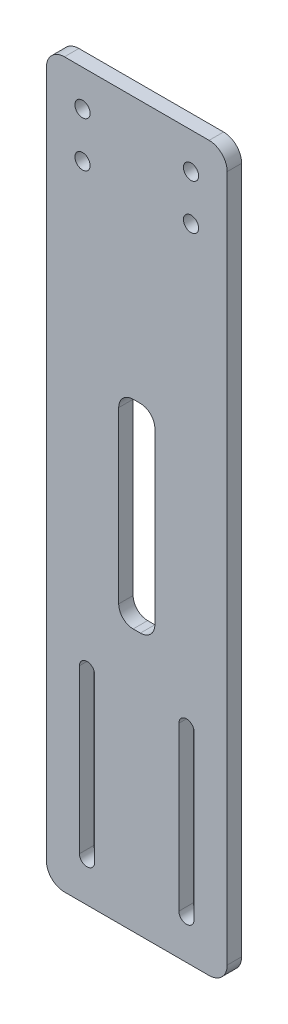
ISO-10303-21;
HEADER;
FILE_DESCRIPTION(('STEP AP214'),'2;1');
FILE_NAME('part.step','',(''),(''),'','','');
FILE_SCHEMA(('AUTOMOTIVE_DESIGN { 1 0 10303 214 1 1 1 1 }'));
ENDSEC;
DATA;
#1=APPLICATION_CONTEXT('core data for automotive mechanical design processes');
#2=APPLICATION_PROTOCOL_DEFINITION('international standard','automotive_design',2000,#1);
#3=PRODUCT_CONTEXT('',#1,'mechanical');
#4=PRODUCT('Part','Part','',(#3));
#5=PRODUCT_RELATED_PRODUCT_CATEGORY('part','',(#4));
#6=PRODUCT_DEFINITION_FORMATION('','',#4);
#7=PRODUCT_DEFINITION_CONTEXT('part definition',#1,'design');
#8=PRODUCT_DEFINITION('design','',#6,#7);
#9=PRODUCT_DEFINITION_SHAPE('','',#8);
#10=(LENGTH_UNIT() NAMED_UNIT(*) SI_UNIT(.MILLI.,.METRE.));
#11=(NAMED_UNIT(*) PLANE_ANGLE_UNIT() SI_UNIT($,.RADIAN.));
#12=(NAMED_UNIT(*) SI_UNIT($,.STERADIAN.) SOLID_ANGLE_UNIT());
#13=UNCERTAINTY_MEASURE_WITH_UNIT(LENGTH_MEASURE(1.E-05),#10,'distance_accuracy_value','');
#14=(GEOMETRIC_REPRESENTATION_CONTEXT(3) GLOBAL_UNCERTAINTY_ASSIGNED_CONTEXT((#13)) GLOBAL_UNIT_ASSIGNED_CONTEXT((#10,
#11,#12)) REPRESENTATION_CONTEXT('',''));
#15=CARTESIAN_POINT('',(0.,0.,0.));
#16=DIRECTION('',(0.,0.,1.));
#17=DIRECTION('',(1.,0.,0.));
#18=AXIS2_PLACEMENT_3D('',#15,#16,#17);
#19=CARTESIAN_POINT('',(40.,-190.,-8.));
#20=DIRECTION('',(0.,0.,1.));
#21=DIRECTION('',(1.,0.,0.));
#22=AXIS2_PLACEMENT_3D('',#19,#20,#21);
#23=CYLINDRICAL_SURFACE('',#22,10.);
#24=CARTESIAN_POINT('',(40.,-190.,0.));
#25=DIRECTION('',(0.,0.,1.));
#26=DIRECTION('',(1.,0.,0.));
#27=AXIS2_PLACEMENT_3D('',#24,#25,#26);
#28=CIRCLE('',#27,10.);
#29=CARTESIAN_POINT('',(40.,-200.,0.));
#30=VERTEX_POINT('',#29);
#31=CARTESIAN_POINT('',(50.,-190.,0.));
#32=VERTEX_POINT('',#31);
#33=EDGE_CURVE('E353',#30,#32,#28,.T.);
#34=ORIENTED_EDGE('',*,*,#33,.F.);
#35=DIRECTION('',(0.,0.,1.));
#36=VECTOR('',#35,1.);
#37=CARTESIAN_POINT('',(40.,-200.,-8.));
#38=LINE('',#37,#36);
#39=CARTESIAN_POINT('',(40.,-200.,-8.));
#40=VERTEX_POINT('',#39);
#41=EDGE_CURVE('E11',#40,#30,#38,.T.);
#42=ORIENTED_EDGE('',*,*,#41,.F.);
#43=CARTESIAN_POINT('',(40.,-190.,-8.));
#44=DIRECTION('',(0.,0.,1.));
#45=DIRECTION('',(1.,0.,0.));
#46=AXIS2_PLACEMENT_3D('',#43,#44,#45);
#47=CIRCLE('',#46,10.);
#48=CARTESIAN_POINT('',(50.,-190.,-8.));
#49=VERTEX_POINT('',#48);
#50=EDGE_CURVE('E360',#40,#49,#47,.T.);
#51=ORIENTED_EDGE('',*,*,#50,.T.);
#52=DIRECTION('',(0.,0.,1.));
#53=VECTOR('',#52,1.);
#54=CARTESIAN_POINT('',(50.,-190.,-8.));
#55=LINE('',#54,#53);
#56=EDGE_CURVE('E45',#49,#32,#55,.T.);
#57=ORIENTED_EDGE('',*,*,#56,.T.);
#58=EDGE_LOOP('',(#34,#42,#51,#57));
#59=FACE_BOUND('',#58,.T.);
#60=ADVANCED_FACE('F42',(#59),#23,.T.);
#61=CARTESIAN_POINT('',(-39.9999999999999,-200.,-8.));
#62=DIRECTION('',(0.,-1.,0.));
#63=DIRECTION('',(0.,0.,-1.));
#64=AXIS2_PLACEMENT_3D('',#61,#62,#63);
#65=PLANE('',#64);
#66=DIRECTION('',(1.,0.,0.));
#67=VECTOR('',#66,1.);
#68=CARTESIAN_POINT('',(-39.9999999999999,-200.,0.));
#69=LINE('',#68,#67);
#70=CARTESIAN_POINT('',(-39.9999999999999,-200.,0.));
#71=VERTEX_POINT('',#70);
#72=EDGE_CURVE('E364',#71,#30,#69,.T.);
#73=ORIENTED_EDGE('',*,*,#72,.F.);
#74=DIRECTION('',(0.,0.,1.));
#75=VECTOR('',#74,1.);
#76=CARTESIAN_POINT('',(-39.9999999999999,-200.,-8.));
#77=LINE('',#76,#75);
#78=CARTESIAN_POINT('',(-39.9999999999999,-200.,-8.));
#79=VERTEX_POINT('',#78);
#80=EDGE_CURVE('E50',#79,#71,#77,.T.);
#81=ORIENTED_EDGE('',*,*,#80,.F.);
#82=DIRECTION('',(1.,0.,0.));
#83=VECTOR('',#82,1.);
#84=CARTESIAN_POINT('',(-39.9999999999999,-200.,-8.));
#85=LINE('',#84,#83);
#86=EDGE_CURVE('E382',#79,#40,#85,.T.);
#87=ORIENTED_EDGE('',*,*,#86,.T.);
#88=ORIENTED_EDGE('',*,*,#41,.T.);
#89=EDGE_LOOP('',(#73,#81,#87,#88));
#90=FACE_BOUND('',#89,.T.);
#91=ADVANCED_FACE('F429',(#90),#65,.T.);
#92=CARTESIAN_POINT('',(-40.,-190.,-8.));
#93=DIRECTION('',(0.,0.,1.));
#94=DIRECTION('',(1.,0.,0.));
#95=AXIS2_PLACEMENT_3D('',#92,#93,#94);
#96=CYLINDRICAL_SURFACE('',#95,10.);
#97=CARTESIAN_POINT('',(-40.,-190.,0.));
#98=DIRECTION('',(0.,0.,1.));
#99=DIRECTION('',(-1.,0.,0.));
#100=AXIS2_PLACEMENT_3D('',#97,#98,#99);
#101=CIRCLE('',#100,10.);
#102=CARTESIAN_POINT('',(-50.,-190.,0.));
#103=VERTEX_POINT('',#102);
#104=EDGE_CURVE('E402',#103,#71,#101,.T.);
#105=ORIENTED_EDGE('',*,*,#104,.F.);
#106=DIRECTION('',(0.,0.,1.));
#107=VECTOR('',#106,1.);
#108=CARTESIAN_POINT('',(-50.,-190.,-8.));
#109=LINE('',#108,#107);
#110=CARTESIAN_POINT('',(-50.,-190.,-8.));
#111=VERTEX_POINT('',#110);
#112=EDGE_CURVE('E408',#111,#103,#109,.T.);
#113=ORIENTED_EDGE('',*,*,#112,.F.);
#114=CARTESIAN_POINT('',(-40.,-190.,-8.));
#115=DIRECTION('',(0.,0.,1.));
#116=DIRECTION('',(-1.,0.,0.));
#117=AXIS2_PLACEMENT_3D('',#114,#115,#116);
#118=CIRCLE('',#117,10.);
#119=EDGE_CURVE('E379',#111,#79,#118,.T.);
#120=ORIENTED_EDGE('',*,*,#119,.T.);
#121=ORIENTED_EDGE('',*,*,#80,.T.);
#122=EDGE_LOOP('',(#105,#113,#120,#121));
#123=FACE_BOUND('',#122,.T.);
#124=ADVANCED_FACE('F449',(#123),#96,.T.);
#125=CARTESIAN_POINT('',(-50.,190.,-8.));
#126=DIRECTION('',(-1.,0.,0.));
#127=DIRECTION('',(0.,-1.,0.));
#128=AXIS2_PLACEMENT_3D('',#125,#126,#127);
#129=PLANE('',#128);
#130=DIRECTION('',(0.,-1.,0.));
#131=VECTOR('',#130,1.);
#132=CARTESIAN_POINT('',(-50.,190.,0.));
#133=LINE('',#132,#131);
#134=CARTESIAN_POINT('',(-50.,190.,0.));
#135=VERTEX_POINT('',#134);
#136=EDGE_CURVE('E399',#135,#103,#133,.T.);
#137=ORIENTED_EDGE('',*,*,#136,.F.);
#138=DIRECTION('',(0.,0.,1.));
#139=VECTOR('',#138,1.);
#140=CARTESIAN_POINT('',(-50.,190.,-8.));
#141=LINE('',#140,#139);
#142=CARTESIAN_POINT('',(-50.,190.,-8.));
#143=VERTEX_POINT('',#142);
#144=EDGE_CURVE('E410',#143,#135,#141,.T.);
#145=ORIENTED_EDGE('',*,*,#144,.F.);
#146=DIRECTION('',(0.,-1.,0.));
#147=VECTOR('',#146,1.);
#148=CARTESIAN_POINT('',(-50.,190.,-8.));
#149=LINE('',#148,#147);
#150=EDGE_CURVE('E376',#143,#111,#149,.T.);
#151=ORIENTED_EDGE('',*,*,#150,.T.);
#152=ORIENTED_EDGE('',*,*,#112,.T.);
#153=EDGE_LOOP('',(#137,#145,#151,#152));
#154=FACE_BOUND('',#153,.T.);
#155=ADVANCED_FACE('F447',(#154),#129,.T.);
#156=CARTESIAN_POINT('',(-40.,190.,-8.));
#157=DIRECTION('',(0.,0.,1.));
#158=DIRECTION('',(1.,0.,0.));
#159=AXIS2_PLACEMENT_3D('',#156,#157,#158);
#160=CYLINDRICAL_SURFACE('',#159,10.);
#161=CARTESIAN_POINT('',(-40.,190.,0.));
#162=DIRECTION('',(0.,0.,1.));
#163=DIRECTION('',(1.,0.,0.));
#164=AXIS2_PLACEMENT_3D('',#161,#162,#163);
#165=CIRCLE('',#164,10.);
#166=CARTESIAN_POINT('',(-39.9999999999999,200.,0.));
#167=VERTEX_POINT('',#166);
#168=EDGE_CURVE('E396',#167,#135,#165,.T.);
#169=ORIENTED_EDGE('',*,*,#168,.F.);
#170=DIRECTION('',(0.,0.,1.));
#171=VECTOR('',#170,1.);
#172=CARTESIAN_POINT('',(-39.9999999999999,200.,-8.));
#173=LINE('',#172,#171);
#174=CARTESIAN_POINT('',(-39.9999999999999,200.,-8.));
#175=VERTEX_POINT('',#174);
#176=EDGE_CURVE('E412',#175,#167,#173,.T.);
#177=ORIENTED_EDGE('',*,*,#176,.F.);
#178=CARTESIAN_POINT('',(-40.,190.,-8.));
#179=DIRECTION('',(0.,0.,1.));
#180=DIRECTION('',(1.,0.,0.));
#181=AXIS2_PLACEMENT_3D('',#178,#179,#180);
#182=CIRCLE('',#181,10.);
#183=EDGE_CURVE('E373',#175,#143,#182,.T.);
#184=ORIENTED_EDGE('',*,*,#183,.T.);
#185=ORIENTED_EDGE('',*,*,#144,.T.);
#186=EDGE_LOOP('',(#169,#177,#184,#185));
#187=FACE_BOUND('',#186,.T.);
#188=ADVANCED_FACE('F443',(#187),#160,.T.);
#189=CARTESIAN_POINT('',(-39.9999999999999,200.,-8.));
#190=DIRECTION('',(0.,1.,0.));
#191=DIRECTION('',(0.,0.,1.));
#192=AXIS2_PLACEMENT_3D('',#189,#190,#191);
#193=PLANE('',#192);
#194=DIRECTION('',(-1.,0.,0.));
#195=VECTOR('',#194,1.);
#196=CARTESIAN_POINT('',(-39.9999999999999,200.,0.));
#197=LINE('',#196,#195);
#198=CARTESIAN_POINT('',(39.9999999999999,200.,0.));
#199=VERTEX_POINT('',#198);
#200=EDGE_CURVE('E393',#199,#167,#197,.T.);
#201=ORIENTED_EDGE('',*,*,#200,.F.);
#202=DIRECTION('',(0.,0.,1.));
#203=VECTOR('',#202,1.);
#204=CARTESIAN_POINT('',(39.9999999999999,200.,-8.));
#205=LINE('',#204,#203);
#206=CARTESIAN_POINT('',(39.9999999999999,200.,-8.));
#207=VERTEX_POINT('',#206);
#208=EDGE_CURVE('E414',#207,#199,#205,.T.);
#209=ORIENTED_EDGE('',*,*,#208,.F.);
#210=DIRECTION('',(-1.,0.,0.));
#211=VECTOR('',#210,1.);
#212=CARTESIAN_POINT('',(-39.9999999999999,200.,-8.));
#213=LINE('',#212,#211);
#214=EDGE_CURVE('E370',#207,#175,#213,.T.);
#215=ORIENTED_EDGE('',*,*,#214,.T.);
#216=ORIENTED_EDGE('',*,*,#176,.T.);
#217=EDGE_LOOP('',(#201,#209,#215,#216));
#218=FACE_BOUND('',#217,.T.);
#219=ADVANCED_FACE('F441',(#218),#193,.T.);
#220=CARTESIAN_POINT('',(40.,190.,-8.));
#221=DIRECTION('',(0.,0.,1.));
#222=DIRECTION('',(1.,0.,0.));
#223=AXIS2_PLACEMENT_3D('',#220,#221,#222);
#224=CYLINDRICAL_SURFACE('',#223,10.);
#225=CARTESIAN_POINT('',(40.,190.,0.));
#226=DIRECTION('',(0.,0.,1.));
#227=DIRECTION('',(1.,0.,0.));
#228=AXIS2_PLACEMENT_3D('',#225,#226,#227);
#229=CIRCLE('',#228,10.);
#230=CARTESIAN_POINT('',(50.,190.,0.));
#231=VERTEX_POINT('',#230);
#232=EDGE_CURVE('E390',#231,#199,#229,.T.);
#233=ORIENTED_EDGE('',*,*,#232,.F.);
#234=DIRECTION('',(0.,0.,1.));
#235=VECTOR('',#234,1.);
#236=CARTESIAN_POINT('',(50.,190.,-8.));
#237=LINE('',#236,#235);
#238=CARTESIAN_POINT('',(50.,190.,-8.));
#239=VERTEX_POINT('',#238);
#240=EDGE_CURVE('E415',#239,#231,#237,.T.);
#241=ORIENTED_EDGE('',*,*,#240,.F.);
#242=CARTESIAN_POINT('',(40.,190.,-8.));
#243=DIRECTION('',(0.,0.,1.));
#244=DIRECTION('',(1.,0.,0.));
#245=AXIS2_PLACEMENT_3D('',#242,#243,#244);
#246=CIRCLE('',#245,10.);
#247=EDGE_CURVE('E367',#239,#207,#246,.T.);
#248=ORIENTED_EDGE('',*,*,#247,.T.);
#249=ORIENTED_EDGE('',*,*,#208,.T.);
#250=EDGE_LOOP('',(#233,#241,#248,#249));
#251=FACE_BOUND('',#250,.T.);
#252=ADVANCED_FACE('F437',(#251),#224,.T.);
#253=CARTESIAN_POINT('',(50.,190.,-8.));
#254=DIRECTION('',(1.,0.,0.));
#255=DIRECTION('',(0.,1.,0.));
#256=AXIS2_PLACEMENT_3D('',#253,#254,#255);
#257=PLANE('',#256);
#258=DIRECTION('',(0.,1.,0.));
#259=VECTOR('',#258,1.);
#260=CARTESIAN_POINT('',(50.,190.,0.));
#261=LINE('',#260,#259);
#262=EDGE_CURVE('E387',#32,#231,#261,.T.);
#263=ORIENTED_EDGE('',*,*,#262,.F.);
#264=ORIENTED_EDGE('',*,*,#56,.F.);
#265=DIRECTION('',(0.,1.,0.));
#266=VECTOR('',#265,1.);
#267=CARTESIAN_POINT('',(50.,190.,-8.));
#268=LINE('',#267,#266);
#269=EDGE_CURVE('E363',#49,#239,#268,.T.);
#270=ORIENTED_EDGE('',*,*,#269,.T.);
#271=ORIENTED_EDGE('',*,*,#240,.T.);
#272=EDGE_LOOP('',(#263,#264,#270,#271));
#273=FACE_BOUND('',#272,.T.);
#274=ADVANCED_FACE('F423',(#273),#257,.T.);
#275=CARTESIAN_POINT('',(40.,-190.,-8.));
#276=DIRECTION('',(0.,0.,1.));
#277=DIRECTION('',(1.,0.,0.));
#278=AXIS2_PLACEMENT_3D('',#275,#276,#277);
#279=PLANE('',#278);
#280=DIRECTION('',(0.,-1.,0.));
#281=VECTOR('',#280,1.);
#282=CARTESIAN_POINT('',(-9.99999999999998,-47.,-8.));
#283=LINE('',#282,#281);
#284=CARTESIAN_POINT('',(-9.99999999999998,47.,-8.));
#285=VERTEX_POINT('',#284);
#286=CARTESIAN_POINT('',(-9.99999999999998,-47.,-8.));
#287=VERTEX_POINT('',#286);
#288=EDGE_CURVE('E211',#285,#287,#283,.T.);
#289=ORIENTED_EDGE('',*,*,#288,.T.);
#290=CARTESIAN_POINT('',(-1.99999999999998,-47.,-8.));
#291=DIRECTION('',(0.,0.,1.));
#292=DIRECTION('',(-1.,0.,0.));
#293=AXIS2_PLACEMENT_3D('',#290,#291,#292);
#294=CIRCLE('',#293,8.);
#295=CARTESIAN_POINT('',(-1.99999999999998,-55.,-8.));
#296=VERTEX_POINT('',#295);
#297=EDGE_CURVE('E205',#287,#296,#294,.T.);
#298=ORIENTED_EDGE('',*,*,#297,.T.);
#299=DIRECTION('',(1.,0.,0.));
#300=VECTOR('',#299,1.);
#301=CARTESIAN_POINT('',(-1.99999999999998,-55.,-8.));
#302=LINE('',#301,#300);
#303=CARTESIAN_POINT('',(2.00000000000002,-55.,-8.));
#304=VERTEX_POINT('',#303);
#305=EDGE_CURVE('E214',#296,#304,#302,.T.);
#306=ORIENTED_EDGE('',*,*,#305,.T.);
#307=CARTESIAN_POINT('',(2.00000000000002,-47.,-8.));
#308=DIRECTION('',(0.,0.,1.));
#309=DIRECTION('',(1.,0.,0.));
#310=AXIS2_PLACEMENT_3D('',#307,#308,#309);
#311=CIRCLE('',#310,8.);
#312=CARTESIAN_POINT('',(10.,-47.,-8.));
#313=VERTEX_POINT('',#312);
#314=EDGE_CURVE('E58',#304,#313,#311,.T.);
#315=ORIENTED_EDGE('',*,*,#314,.T.);
#316=DIRECTION('',(0.,1.,0.));
#317=VECTOR('',#316,1.);
#318=CARTESIAN_POINT('',(10.,-47.,-8.));
#319=LINE('',#318,#317);
#320=CARTESIAN_POINT('',(10.,47.,-8.));
#321=VERTEX_POINT('',#320);
#322=EDGE_CURVE('E229',#313,#321,#319,.T.);
#323=ORIENTED_EDGE('',*,*,#322,.T.);
#324=CARTESIAN_POINT('',(2.00000000000002,47.,-8.));
#325=DIRECTION('',(0.,0.,1.));
#326=DIRECTION('',(-1.,0.,0.));
#327=AXIS2_PLACEMENT_3D('',#324,#325,#326);
#328=CIRCLE('',#327,8.);
#329=CARTESIAN_POINT('',(2.00000000000002,55.,-8.));
#330=VERTEX_POINT('',#329);
#331=EDGE_CURVE('E232',#321,#330,#328,.T.);
#332=ORIENTED_EDGE('',*,*,#331,.T.);
#333=DIRECTION('',(-1.,0.,0.));
#334=VECTOR('',#333,1.);
#335=CARTESIAN_POINT('',(-1.99999999999998,55.,-8.));
#336=LINE('',#335,#334);
#337=CARTESIAN_POINT('',(-1.99999999999998,55.,-8.));
#338=VERTEX_POINT('',#337);
#339=EDGE_CURVE('E235',#330,#338,#336,.T.);
#340=ORIENTED_EDGE('',*,*,#339,.T.);
#341=CARTESIAN_POINT('',(-1.99999999999998,47.,-8.));
#342=DIRECTION('',(0.,0.,1.));
#343=DIRECTION('',(1.,0.,0.));
#344=AXIS2_PLACEMENT_3D('',#341,#342,#343);
#345=CIRCLE('',#344,8.);
#346=EDGE_CURVE('E238',#338,#285,#345,.T.);
#347=ORIENTED_EDGE('',*,*,#346,.T.);
#348=EDGE_LOOP('',(#289,#298,#306,#315,#323,#332,#340,#347));
#349=FACE_BOUND('',#348,.T.);
#350=CARTESIAN_POINT('',(30.,155.,-8.));
#351=DIRECTION('',(0.,0.,1.));
#352=DIRECTION('',(1.,0.,0.));
#353=AXIS2_PLACEMENT_3D('',#350,#351,#352);
#354=CIRCLE('',#353,4.2);
#355=CARTESIAN_POINT('',(34.2,155.,-8.));
#356=VERTEX_POINT('',#355);
#357=EDGE_CURVE('E272',#356,#356,#354,.T.);
#358=ORIENTED_EDGE('',*,*,#357,.T.);
#359=EDGE_LOOP('',(#358));
#360=FACE_BOUND('',#359,.T.);
#361=CARTESIAN_POINT('',(-30.,155.,-8.));
#362=DIRECTION('',(0.,0.,1.));
#363=DIRECTION('',(1.,0.,0.));
#364=AXIS2_PLACEMENT_3D('',#361,#362,#363);
#365=CIRCLE('',#364,4.2);
#366=CARTESIAN_POINT('',(-25.8,155.,-8.));
#367=VERTEX_POINT('',#366);
#368=EDGE_CURVE('E278',#367,#367,#365,.T.);
#369=ORIENTED_EDGE('',*,*,#368,.T.);
#370=EDGE_LOOP('',(#369));
#371=FACE_BOUND('',#370,.T.);
#372=CARTESIAN_POINT('',(30.,180.,-8.));
#373=DIRECTION('',(0.,0.,1.));
#374=DIRECTION('',(1.,0.,0.));
#375=AXIS2_PLACEMENT_3D('',#372,#373,#374);
#376=CIRCLE('',#375,4.2);
#377=CARTESIAN_POINT('',(34.2,180.,-8.));
#378=VERTEX_POINT('',#377);
#379=EDGE_CURVE('E284',#378,#378,#376,.T.);
#380=ORIENTED_EDGE('',*,*,#379,.T.);
#381=EDGE_LOOP('',(#380));
#382=FACE_BOUND('',#381,.T.);
#383=CARTESIAN_POINT('',(-30.,180.,-8.));
#384=DIRECTION('',(0.,0.,1.));
#385=DIRECTION('',(1.,0.,0.));
#386=AXIS2_PLACEMENT_3D('',#383,#384,#385);
#387=CIRCLE('',#386,4.2);
#388=CARTESIAN_POINT('',(-25.8,180.,-8.));
#389=VERTEX_POINT('',#388);
#390=EDGE_CURVE('E290',#389,#389,#387,.T.);
#391=ORIENTED_EDGE('',*,*,#390,.T.);
#392=EDGE_LOOP('',(#391));
#393=FACE_BOUND('',#392,.T.);
#394=DIRECTION('',(0.,1.,0.));
#395=VECTOR('',#394,1.);
#396=CARTESIAN_POINT('',(31.7,-87.5,-8.));
#397=LINE('',#396,#395);
#398=CARTESIAN_POINT('',(31.7,-177.5,-8.));
#399=VERTEX_POINT('',#398);
#400=CARTESIAN_POINT('',(31.7,-87.5,-8.));
#401=VERTEX_POINT('',#400);
#402=EDGE_CURVE('E306',#399,#401,#397,.T.);
#403=ORIENTED_EDGE('',*,*,#402,.T.);
#404=CARTESIAN_POINT('',(27.5,-87.5,-8.));
#405=DIRECTION('',(0.,0.,1.));
#406=DIRECTION('',(1.,0.,0.));
#407=AXIS2_PLACEMENT_3D('',#404,#405,#406);
#408=CIRCLE('',#407,4.19999999999999);
#409=CARTESIAN_POINT('',(23.3,-87.5,-8.));
#410=VERTEX_POINT('',#409);
#411=EDGE_CURVE('E296',#401,#410,#408,.T.);
#412=ORIENTED_EDGE('',*,*,#411,.T.);
#413=DIRECTION('',(0.,-1.,0.));
#414=VECTOR('',#413,1.);
#415=CARTESIAN_POINT('',(23.3,-87.5,-8.));
#416=LINE('',#415,#414);
#417=CARTESIAN_POINT('',(23.3,-177.5,-8.));
#418=VERTEX_POINT('',#417);
#419=EDGE_CURVE('E299',#410,#418,#416,.T.);
#420=ORIENTED_EDGE('',*,*,#419,.T.);
#421=CARTESIAN_POINT('',(27.5,-177.5,-8.));
#422=DIRECTION('',(0.,0.,1.));
#423=DIRECTION('',(1.,0.,0.));
#424=AXIS2_PLACEMENT_3D('',#421,#422,#423);
#425=CIRCLE('',#424,4.2);
#426=EDGE_CURVE('E303',#418,#399,#425,.T.);
#427=ORIENTED_EDGE('',*,*,#426,.T.);
#428=EDGE_LOOP('',(#403,#412,#420,#427));
#429=FACE_BOUND('',#428,.T.);
#430=DIRECTION('',(0.,-1.,0.));
#431=VECTOR('',#430,1.);
#432=CARTESIAN_POINT('',(-31.7,-87.5,-8.));
#433=LINE('',#432,#431);
#434=CARTESIAN_POINT('',(-31.7,-87.5,-8.));
#435=VERTEX_POINT('',#434);
#436=CARTESIAN_POINT('',(-31.7,-177.5,-8.));
#437=VERTEX_POINT('',#436);
#438=EDGE_CURVE('E338',#435,#437,#433,.T.);
#439=ORIENTED_EDGE('',*,*,#438,.T.);
#440=CARTESIAN_POINT('',(-27.5,-177.5,-8.));
#441=DIRECTION('',(0.,0.,1.));
#442=DIRECTION('',(1.,0.,0.));
#443=AXIS2_PLACEMENT_3D('',#440,#441,#442);
#444=CIRCLE('',#443,4.2);
#445=CARTESIAN_POINT('',(-23.3,-177.5,-8.));
#446=VERTEX_POINT('',#445);
#447=EDGE_CURVE('E328',#437,#446,#444,.T.);
#448=ORIENTED_EDGE('',*,*,#447,.T.);
#449=DIRECTION('',(0.,1.,0.));
#450=VECTOR('',#449,1.);
#451=CARTESIAN_POINT('',(-23.3,-177.5,-8.));
#452=LINE('',#451,#450);
#453=CARTESIAN_POINT('',(-23.3,-87.5000000000001,-8.));
#454=VERTEX_POINT('',#453);
#455=EDGE_CURVE('E331',#446,#454,#452,.T.);
#456=ORIENTED_EDGE('',*,*,#455,.T.);
#457=CARTESIAN_POINT('',(-27.5,-87.5,-8.));
#458=DIRECTION('',(0.,0.,1.));
#459=DIRECTION('',(1.,0.,0.));
#460=AXIS2_PLACEMENT_3D('',#457,#458,#459);
#461=CIRCLE('',#460,4.19999999999999);
#462=EDGE_CURVE('E335',#454,#435,#461,.T.);
#463=ORIENTED_EDGE('',*,*,#462,.T.);
#464=EDGE_LOOP('',(#439,#448,#456,#463));
#465=FACE_BOUND('',#464,.T.);
#466=ORIENTED_EDGE('',*,*,#50,.F.);
#467=ORIENTED_EDGE('',*,*,#86,.F.);
#468=ORIENTED_EDGE('',*,*,#119,.F.);
#469=ORIENTED_EDGE('',*,*,#150,.F.);
#470=ORIENTED_EDGE('',*,*,#183,.F.);
#471=ORIENTED_EDGE('',*,*,#214,.F.);
#472=ORIENTED_EDGE('',*,*,#247,.F.);
#473=ORIENTED_EDGE('',*,*,#269,.F.);
#474=EDGE_LOOP('',(#466,#467,#468,#469,#470,#471,#472,#473));
#475=FACE_BOUND('',#474,.T.);
#476=ADVANCED_FACE('F218',(#349,#360,#371,#382,#393,#429,#465,#475),#279,.F.);
#477=CARTESIAN_POINT('',(40.,-190.,0.));
#478=DIRECTION('',(0.,0.,1.));
#479=DIRECTION('',(1.,0.,0.));
#480=AXIS2_PLACEMENT_3D('',#477,#478,#479);
#481=PLANE('',#480);
#482=CARTESIAN_POINT('',(-1.99999999999998,-47.,0.));
#483=DIRECTION('',(0.,0.,1.));
#484=DIRECTION('',(-1.,0.,0.));
#485=AXIS2_PLACEMENT_3D('',#482,#483,#484);
#486=CIRCLE('',#485,8.);
#487=CARTESIAN_POINT('',(-9.99999999999998,-47.,0.));
#488=VERTEX_POINT('',#487);
#489=CARTESIAN_POINT('',(-1.99999999999998,-55.,0.));
#490=VERTEX_POINT('',#489);
#491=EDGE_CURVE('E66',#488,#490,#486,.T.);
#492=ORIENTED_EDGE('',*,*,#491,.F.);
#493=DIRECTION('',(0.,-1.,0.));
#494=VECTOR('',#493,1.);
#495=CARTESIAN_POINT('',(-9.99999999999998,-47.,0.));
#496=LINE('',#495,#494);
#497=CARTESIAN_POINT('',(-9.99999999999998,47.,0.));
#498=VERTEX_POINT('',#497);
#499=EDGE_CURVE('E222',#498,#488,#496,.T.);
#500=ORIENTED_EDGE('',*,*,#499,.F.);
#501=CARTESIAN_POINT('',(-1.99999999999998,47.,0.));
#502=DIRECTION('',(0.,0.,1.));
#503=DIRECTION('',(1.,0.,0.));
#504=AXIS2_PLACEMENT_3D('',#501,#502,#503);
#505=CIRCLE('',#504,8.);
#506=CARTESIAN_POINT('',(-1.99999999999998,55.,0.));
#507=VERTEX_POINT('',#506);
#508=EDGE_CURVE('E225',#507,#498,#505,.T.);
#509=ORIENTED_EDGE('',*,*,#508,.F.);
#510=DIRECTION('',(-1.,0.,0.));
#511=VECTOR('',#510,1.);
#512=CARTESIAN_POINT('',(-1.99999999999998,55.,0.));
#513=LINE('',#512,#511);
#514=CARTESIAN_POINT('',(2.00000000000002,55.,0.));
#515=VERTEX_POINT('',#514);
#516=EDGE_CURVE('E253',#515,#507,#513,.T.);
#517=ORIENTED_EDGE('',*,*,#516,.F.);
#518=CARTESIAN_POINT('',(2.00000000000002,47.,0.));
#519=DIRECTION('',(0.,0.,1.));
#520=DIRECTION('',(-1.,0.,0.));
#521=AXIS2_PLACEMENT_3D('',#518,#519,#520);
#522=CIRCLE('',#521,8.);
#523=CARTESIAN_POINT('',(10.,47.,0.));
#524=VERTEX_POINT('',#523);
#525=EDGE_CURVE('E250',#524,#515,#522,.T.);
#526=ORIENTED_EDGE('',*,*,#525,.F.);
#527=DIRECTION('',(0.,1.,0.));
#528=VECTOR('',#527,1.);
#529=CARTESIAN_POINT('',(10.,-47.,0.));
#530=LINE('',#529,#528);
#531=CARTESIAN_POINT('',(10.,-47.,0.));
#532=VERTEX_POINT('',#531);
#533=EDGE_CURVE('E247',#532,#524,#530,.T.);
#534=ORIENTED_EDGE('',*,*,#533,.F.);
#535=CARTESIAN_POINT('',(2.00000000000002,-47.,0.));
#536=DIRECTION('',(0.,0.,1.));
#537=DIRECTION('',(1.,0.,0.));
#538=AXIS2_PLACEMENT_3D('',#535,#536,#537);
#539=CIRCLE('',#538,8.);
#540=CARTESIAN_POINT('',(2.00000000000002,-55.,0.));
#541=VERTEX_POINT('',#540);
#542=EDGE_CURVE('E244',#541,#532,#539,.T.);
#543=ORIENTED_EDGE('',*,*,#542,.F.);
#544=DIRECTION('',(1.,0.,0.));
#545=VECTOR('',#544,1.);
#546=CARTESIAN_POINT('',(-1.99999999999998,-55.,0.));
#547=LINE('',#546,#545);
#548=EDGE_CURVE('E242',#490,#541,#547,.T.);
#549=ORIENTED_EDGE('',*,*,#548,.F.);
#550=EDGE_LOOP('',(#492,#500,#509,#517,#526,#534,#543,#549));
#551=FACE_BOUND('',#550,.T.);
#552=CARTESIAN_POINT('',(30.,155.,0.));
#553=DIRECTION('',(0.,0.,1.));
#554=DIRECTION('',(1.,0.,0.));
#555=AXIS2_PLACEMENT_3D('',#552,#553,#554);
#556=CIRCLE('',#555,4.2);
#557=CARTESIAN_POINT('',(34.2,155.,0.));
#558=VERTEX_POINT('',#557);
#559=EDGE_CURVE('E260',#558,#558,#556,.T.);
#560=ORIENTED_EDGE('',*,*,#559,.F.);
#561=EDGE_LOOP('',(#560));
#562=FACE_BOUND('',#561,.T.);
#563=CARTESIAN_POINT('',(-30.,155.,0.));
#564=DIRECTION('',(0.,0.,1.));
#565=DIRECTION('',(1.,0.,0.));
#566=AXIS2_PLACEMENT_3D('',#563,#564,#565);
#567=CIRCLE('',#566,4.2);
#568=CARTESIAN_POINT('',(-25.8,155.,0.));
#569=VERTEX_POINT('',#568);
#570=EDGE_CURVE('E275',#569,#569,#567,.T.);
#571=ORIENTED_EDGE('',*,*,#570,.F.);
#572=EDGE_LOOP('',(#571));
#573=FACE_BOUND('',#572,.T.);
#574=CARTESIAN_POINT('',(30.,180.,0.));
#575=DIRECTION('',(0.,0.,1.));
#576=DIRECTION('',(1.,0.,0.));
#577=AXIS2_PLACEMENT_3D('',#574,#575,#576);
#578=CIRCLE('',#577,4.2);
#579=CARTESIAN_POINT('',(34.2,180.,0.));
#580=VERTEX_POINT('',#579);
#581=EDGE_CURVE('E281',#580,#580,#578,.T.);
#582=ORIENTED_EDGE('',*,*,#581,.F.);
#583=EDGE_LOOP('',(#582));
#584=FACE_BOUND('',#583,.T.);
#585=CARTESIAN_POINT('',(-30.,180.,0.));
#586=DIRECTION('',(0.,0.,1.));
#587=DIRECTION('',(1.,0.,0.));
#588=AXIS2_PLACEMENT_3D('',#585,#586,#587);
#589=CIRCLE('',#588,4.2);
#590=CARTESIAN_POINT('',(-25.8,180.,0.));
#591=VERTEX_POINT('',#590);
#592=EDGE_CURVE('E287',#591,#591,#589,.T.);
#593=ORIENTED_EDGE('',*,*,#592,.F.);
#594=EDGE_LOOP('',(#593));
#595=FACE_BOUND('',#594,.T.);
#596=CARTESIAN_POINT('',(27.5,-87.5,0.));
#597=DIRECTION('',(0.,0.,1.));
#598=DIRECTION('',(1.,0.,0.));
#599=AXIS2_PLACEMENT_3D('',#596,#597,#598);
#600=CIRCLE('',#599,4.19999999999999);
#601=CARTESIAN_POINT('',(31.7,-87.5,0.));
#602=VERTEX_POINT('',#601);
#603=CARTESIAN_POINT('',(23.3,-87.5,0.));
#604=VERTEX_POINT('',#603);
#605=EDGE_CURVE('E293',#602,#604,#600,.T.);
#606=ORIENTED_EDGE('',*,*,#605,.F.);
#607=DIRECTION('',(0.,1.,0.));
#608=VECTOR('',#607,1.);
#609=CARTESIAN_POINT('',(31.7,-87.5,0.));
#610=LINE('',#609,#608);
#611=CARTESIAN_POINT('',(31.7,-177.5,0.));
#612=VERTEX_POINT('',#611);
#613=EDGE_CURVE('E300',#612,#602,#610,.T.);
#614=ORIENTED_EDGE('',*,*,#613,.F.);
#615=CARTESIAN_POINT('',(27.5,-177.5,0.));
#616=DIRECTION('',(0.,0.,1.));
#617=DIRECTION('',(1.,0.,0.));
#618=AXIS2_PLACEMENT_3D('',#615,#616,#617);
#619=CIRCLE('',#618,4.2);
#620=CARTESIAN_POINT('',(23.3,-177.5,0.));
#621=VERTEX_POINT('',#620);
#622=EDGE_CURVE('E314',#621,#612,#619,.T.);
#623=ORIENTED_EDGE('',*,*,#622,.F.);
#624=DIRECTION('',(0.,-1.,0.));
#625=VECTOR('',#624,1.);
#626=CARTESIAN_POINT('',(23.3,-87.5,0.));
#627=LINE('',#626,#625);
#628=EDGE_CURVE('E311',#604,#621,#627,.T.);
#629=ORIENTED_EDGE('',*,*,#628,.F.);
#630=EDGE_LOOP('',(#606,#614,#623,#629));
#631=FACE_BOUND('',#630,.T.);
#632=CARTESIAN_POINT('',(-27.5,-177.5,0.));
#633=DIRECTION('',(0.,0.,1.));
#634=DIRECTION('',(1.,0.,0.));
#635=AXIS2_PLACEMENT_3D('',#632,#633,#634);
#636=CIRCLE('',#635,4.2);
#637=CARTESIAN_POINT('',(-31.7,-177.5,0.));
#638=VERTEX_POINT('',#637);
#639=CARTESIAN_POINT('',(-23.3,-177.5,0.));
#640=VERTEX_POINT('',#639);
#641=EDGE_CURVE('E321',#638,#640,#636,.T.);
#642=ORIENTED_EDGE('',*,*,#641,.F.);
#643=DIRECTION('',(0.,-1.,0.));
#644=VECTOR('',#643,1.);
#645=CARTESIAN_POINT('',(-31.7,-87.5,0.));
#646=LINE('',#645,#644);
#647=CARTESIAN_POINT('',(-31.7,-87.5,0.));
#648=VERTEX_POINT('',#647);
#649=EDGE_CURVE('E332',#648,#638,#646,.T.);
#650=ORIENTED_EDGE('',*,*,#649,.F.);
#651=CARTESIAN_POINT('',(-27.5,-87.5,0.));
#652=DIRECTION('',(0.,0.,1.));
#653=DIRECTION('',(1.,0.,0.));
#654=AXIS2_PLACEMENT_3D('',#651,#652,#653);
#655=CIRCLE('',#654,4.19999999999999);
#656=CARTESIAN_POINT('',(-23.3,-87.5000000000001,0.));
#657=VERTEX_POINT('',#656);
#658=EDGE_CURVE('E346',#657,#648,#655,.T.);
#659=ORIENTED_EDGE('',*,*,#658,.F.);
#660=DIRECTION('',(0.,1.,0.));
#661=VECTOR('',#660,1.);
#662=CARTESIAN_POINT('',(-23.3,-177.5,0.));
#663=LINE('',#662,#661);
#664=EDGE_CURVE('E343',#640,#657,#663,.T.);
#665=ORIENTED_EDGE('',*,*,#664,.F.);
#666=EDGE_LOOP('',(#642,#650,#659,#665));
#667=FACE_BOUND('',#666,.T.);
#668=ORIENTED_EDGE('',*,*,#33,.T.);
#669=ORIENTED_EDGE('',*,*,#262,.T.);
#670=ORIENTED_EDGE('',*,*,#232,.T.);
#671=ORIENTED_EDGE('',*,*,#200,.T.);
#672=ORIENTED_EDGE('',*,*,#168,.T.);
#673=ORIENTED_EDGE('',*,*,#136,.T.);
#674=ORIENTED_EDGE('',*,*,#104,.T.);
#675=ORIENTED_EDGE('',*,*,#72,.T.);
#676=EDGE_LOOP('',(#668,#669,#670,#671,#672,#673,#674,#675));
#677=FACE_BOUND('',#676,.T.);
#678=ADVANCED_FACE('F425',(#551,#562,#573,#584,#595,#631,#667,#677),#481,.T.);
#679=CARTESIAN_POINT('',(-27.5,-177.5,-8.));
#680=DIRECTION('',(0.,0.,1.));
#681=DIRECTION('',(1.,0.,0.));
#682=AXIS2_PLACEMENT_3D('',#679,#680,#681);
#683=CYLINDRICAL_SURFACE('',#682,4.2);
#684=ORIENTED_EDGE('',*,*,#641,.T.);
#685=DIRECTION('',(0.,0.,1.));
#686=VECTOR('',#685,1.);
#687=CARTESIAN_POINT('',(-23.3,-177.5,-8.));
#688=LINE('',#687,#686);
#689=EDGE_CURVE('E341',#446,#640,#688,.T.);
#690=ORIENTED_EDGE('',*,*,#689,.F.);
#691=ORIENTED_EDGE('',*,*,#447,.F.);
#692=DIRECTION('',(0.,0.,1.));
#693=VECTOR('',#692,1.);
#694=CARTESIAN_POINT('',(-31.7,-177.5,-8.));
#695=LINE('',#694,#693);
#696=EDGE_CURVE('E351',#437,#638,#695,.T.);
#697=ORIENTED_EDGE('',*,*,#696,.T.);
#698=EDGE_LOOP('',(#684,#690,#691,#697));
#699=FACE_BOUND('',#698,.T.);
#700=ADVANCED_FACE('F533',(#699),#683,.F.);
#701=CARTESIAN_POINT('',(-31.7,-87.5,-8.));
#702=DIRECTION('',(-1.,0.,0.));
#703=DIRECTION('',(0.,-1.,0.));
#704=AXIS2_PLACEMENT_3D('',#701,#702,#703);
#705=PLANE('',#704);
#706=ORIENTED_EDGE('',*,*,#649,.T.);
#707=ORIENTED_EDGE('',*,*,#696,.F.);
#708=ORIENTED_EDGE('',*,*,#438,.F.);
#709=DIRECTION('',(0.,0.,1.));
#710=VECTOR('',#709,1.);
#711=CARTESIAN_POINT('',(-31.7,-87.5,-8.));
#712=LINE('',#711,#710);
#713=EDGE_CURVE('E354',#435,#648,#712,.T.);
#714=ORIENTED_EDGE('',*,*,#713,.T.);
#715=EDGE_LOOP('',(#706,#707,#708,#714));
#716=FACE_BOUND('',#715,.T.);
#717=ADVANCED_FACE('F544',(#716),#705,.F.);
#718=CARTESIAN_POINT('',(-27.5,-87.5,-8.));
#719=DIRECTION('',(0.,0.,1.));
#720=DIRECTION('',(1.,0.,0.));
#721=AXIS2_PLACEMENT_3D('',#718,#719,#720);
#722=CYLINDRICAL_SURFACE('',#721,4.19999999999999);
#723=ORIENTED_EDGE('',*,*,#658,.T.);
#724=ORIENTED_EDGE('',*,*,#713,.F.);
#725=ORIENTED_EDGE('',*,*,#462,.F.);
#726=DIRECTION('',(0.,0.,1.));
#727=VECTOR('',#726,1.);
#728=CARTESIAN_POINT('',(-23.3,-87.5000000000001,-8.));
#729=LINE('',#728,#727);
#730=EDGE_CURVE('E356',#454,#657,#729,.T.);
#731=ORIENTED_EDGE('',*,*,#730,.T.);
#732=EDGE_LOOP('',(#723,#724,#725,#731));
#733=FACE_BOUND('',#732,.T.);
#734=ADVANCED_FACE('F555',(#733),#722,.F.);
#735=CARTESIAN_POINT('',(-23.3,-177.5,-8.));
#736=DIRECTION('',(1.,0.,0.));
#737=DIRECTION('',(0.,1.,0.));
#738=AXIS2_PLACEMENT_3D('',#735,#736,#737);
#739=PLANE('',#738);
#740=ORIENTED_EDGE('',*,*,#664,.T.);
#741=ORIENTED_EDGE('',*,*,#730,.F.);
#742=ORIENTED_EDGE('',*,*,#455,.F.);
#743=ORIENTED_EDGE('',*,*,#689,.T.);
#744=EDGE_LOOP('',(#740,#741,#742,#743));
#745=FACE_BOUND('',#744,.T.);
#746=ADVANCED_FACE('F566',(#745),#739,.F.);
#747=CARTESIAN_POINT('',(27.5,-87.5,-8.));
#748=DIRECTION('',(0.,0.,1.));
#749=DIRECTION('',(1.,0.,0.));
#750=AXIS2_PLACEMENT_3D('',#747,#748,#749);
#751=CYLINDRICAL_SURFACE('',#750,4.19999999999999);
#752=ORIENTED_EDGE('',*,*,#605,.T.);
#753=DIRECTION('',(0.,0.,1.));
#754=VECTOR('',#753,1.);
#755=CARTESIAN_POINT('',(23.3,-87.5,-8.));
#756=LINE('',#755,#754);
#757=EDGE_CURVE('E309',#410,#604,#756,.T.);
#758=ORIENTED_EDGE('',*,*,#757,.F.);
#759=ORIENTED_EDGE('',*,*,#411,.F.);
#760=DIRECTION('',(0.,0.,1.));
#761=VECTOR('',#760,1.);
#762=CARTESIAN_POINT('',(31.7,-87.5,-8.));
#763=LINE('',#762,#761);
#764=EDGE_CURVE('E319',#401,#602,#763,.T.);
#765=ORIENTED_EDGE('',*,*,#764,.T.);
#766=EDGE_LOOP('',(#752,#758,#759,#765));
#767=FACE_BOUND('',#766,.T.);
#768=ADVANCED_FACE('F577',(#767),#751,.F.);
#769=CARTESIAN_POINT('',(31.7,-87.5,-8.));
#770=DIRECTION('',(1.,0.,0.));
#771=DIRECTION('',(0.,1.,0.));
#772=AXIS2_PLACEMENT_3D('',#769,#770,#771);
#773=PLANE('',#772);
#774=ORIENTED_EDGE('',*,*,#613,.T.);
#775=ORIENTED_EDGE('',*,*,#764,.F.);
#776=ORIENTED_EDGE('',*,*,#402,.F.);
#777=DIRECTION('',(0.,0.,1.));
#778=VECTOR('',#777,1.);
#779=CARTESIAN_POINT('',(31.7,-177.5,-8.));
#780=LINE('',#779,#778);
#781=EDGE_CURVE('E322',#399,#612,#780,.T.);
#782=ORIENTED_EDGE('',*,*,#781,.T.);
#783=EDGE_LOOP('',(#774,#775,#776,#782));
#784=FACE_BOUND('',#783,.T.);
#785=ADVANCED_FACE('F588',(#784),#773,.F.);
#786=CARTESIAN_POINT('',(27.5,-177.5,-8.));
#787=DIRECTION('',(0.,0.,1.));
#788=DIRECTION('',(1.,0.,0.));
#789=AXIS2_PLACEMENT_3D('',#786,#787,#788);
#790=CYLINDRICAL_SURFACE('',#789,4.2);
#791=ORIENTED_EDGE('',*,*,#622,.T.);
#792=ORIENTED_EDGE('',*,*,#781,.F.);
#793=ORIENTED_EDGE('',*,*,#426,.F.);
#794=DIRECTION('',(0.,0.,1.));
#795=VECTOR('',#794,1.);
#796=CARTESIAN_POINT('',(23.3,-177.5,-8.));
#797=LINE('',#796,#795);
#798=EDGE_CURVE('E324',#418,#621,#797,.T.);
#799=ORIENTED_EDGE('',*,*,#798,.T.);
#800=EDGE_LOOP('',(#791,#792,#793,#799));
#801=FACE_BOUND('',#800,.T.);
#802=ADVANCED_FACE('F599',(#801),#790,.F.);
#803=CARTESIAN_POINT('',(23.3,-87.5,-8.));
#804=DIRECTION('',(-1.,0.,0.));
#805=DIRECTION('',(0.,-1.,0.));
#806=AXIS2_PLACEMENT_3D('',#803,#804,#805);
#807=PLANE('',#806);
#808=ORIENTED_EDGE('',*,*,#628,.T.);
#809=ORIENTED_EDGE('',*,*,#798,.F.);
#810=ORIENTED_EDGE('',*,*,#419,.F.);
#811=ORIENTED_EDGE('',*,*,#757,.T.);
#812=EDGE_LOOP('',(#808,#809,#810,#811));
#813=FACE_BOUND('',#812,.T.);
#814=ADVANCED_FACE('F610',(#813),#807,.F.);
#815=CARTESIAN_POINT('',(-30.,180.,-8.));
#816=DIRECTION('',(0.,0.,1.));
#817=DIRECTION('',(1.,0.,0.));
#818=AXIS2_PLACEMENT_3D('',#815,#816,#817);
#819=CYLINDRICAL_SURFACE('',#818,4.2);
#820=ORIENTED_EDGE('',*,*,#390,.F.);
#821=EDGE_LOOP('',(#820));
#822=FACE_BOUND('',#821,.T.);
#823=ORIENTED_EDGE('',*,*,#592,.T.);
#824=EDGE_LOOP('',(#823));
#825=FACE_BOUND('',#824,.T.);
#826=ADVANCED_FACE('F621',(#822,#825),#819,.F.);
#827=CARTESIAN_POINT('',(30.,180.,-8.));
#828=DIRECTION('',(0.,0.,1.));
#829=DIRECTION('',(1.,0.,0.));
#830=AXIS2_PLACEMENT_3D('',#827,#828,#829);
#831=CYLINDRICAL_SURFACE('',#830,4.2);
#832=ORIENTED_EDGE('',*,*,#379,.F.);
#833=EDGE_LOOP('',(#832));
#834=FACE_BOUND('',#833,.T.);
#835=ORIENTED_EDGE('',*,*,#581,.T.);
#836=EDGE_LOOP('',(#835));
#837=FACE_BOUND('',#836,.T.);
#838=ADVANCED_FACE('F632',(#834,#837),#831,.F.);
#839=CARTESIAN_POINT('',(-30.,155.,-8.));
#840=DIRECTION('',(0.,0.,1.));
#841=DIRECTION('',(1.,0.,0.));
#842=AXIS2_PLACEMENT_3D('',#839,#840,#841);
#843=CYLINDRICAL_SURFACE('',#842,4.2);
#844=ORIENTED_EDGE('',*,*,#368,.F.);
#845=EDGE_LOOP('',(#844));
#846=FACE_BOUND('',#845,.T.);
#847=ORIENTED_EDGE('',*,*,#570,.T.);
#848=EDGE_LOOP('',(#847));
#849=FACE_BOUND('',#848,.T.);
#850=ADVANCED_FACE('F643',(#846,#849),#843,.F.);
#851=CARTESIAN_POINT('',(30.,155.,-8.));
#852=DIRECTION('',(0.,0.,1.));
#853=DIRECTION('',(1.,0.,0.));
#854=AXIS2_PLACEMENT_3D('',#851,#852,#853);
#855=CYLINDRICAL_SURFACE('',#854,4.2);
#856=ORIENTED_EDGE('',*,*,#357,.F.);
#857=EDGE_LOOP('',(#856));
#858=FACE_BOUND('',#857,.T.);
#859=ORIENTED_EDGE('',*,*,#559,.T.);
#860=EDGE_LOOP('',(#859));
#861=FACE_BOUND('',#860,.T.);
#862=ADVANCED_FACE('F654',(#858,#861),#855,.F.);
#863=CARTESIAN_POINT('',(-1.99999999999998,-47.,-8.));
#864=DIRECTION('',(0.,0.,1.));
#865=DIRECTION('',(1.,0.,0.));
#866=AXIS2_PLACEMENT_3D('',#863,#864,#865);
#867=CYLINDRICAL_SURFACE('',#866,8.);
#868=ORIENTED_EDGE('',*,*,#491,.T.);
#869=DIRECTION('',(0.,0.,1.));
#870=VECTOR('',#869,1.);
#871=CARTESIAN_POINT('',(-1.99999999999998,-55.,-8.));
#872=LINE('',#871,#870);
#873=EDGE_CURVE('E201',#296,#490,#872,.T.);
#874=ORIENTED_EDGE('',*,*,#873,.F.);
#875=ORIENTED_EDGE('',*,*,#297,.F.);
#876=DIRECTION('',(0.,0.,1.));
#877=VECTOR('',#876,1.);
#878=CARTESIAN_POINT('',(-9.99999999999998,-47.,-8.));
#879=LINE('',#878,#877);
#880=EDGE_CURVE('E258',#287,#488,#879,.T.);
#881=ORIENTED_EDGE('',*,*,#880,.T.);
#882=EDGE_LOOP('',(#868,#874,#875,#881));
#883=FACE_BOUND('',#882,.T.);
#884=ADVANCED_FACE('F203',(#883),#867,.F.);
#885=CARTESIAN_POINT('',(-9.99999999999998,-47.,-8.));
#886=DIRECTION('',(-1.,0.,0.));
#887=DIRECTION('',(0.,0.,1.));
#888=AXIS2_PLACEMENT_3D('',#885,#886,#887);
#889=PLANE('',#888);
#890=ORIENTED_EDGE('',*,*,#499,.T.);
#891=ORIENTED_EDGE('',*,*,#880,.F.);
#892=ORIENTED_EDGE('',*,*,#288,.F.);
#893=DIRECTION('',(0.,0.,1.));
#894=VECTOR('',#893,1.);
#895=CARTESIAN_POINT('',(-9.99999999999998,47.,-8.));
#896=LINE('',#895,#894);
#897=EDGE_CURVE('E261',#285,#498,#896,.T.);
#898=ORIENTED_EDGE('',*,*,#897,.T.);
#899=EDGE_LOOP('',(#890,#891,#892,#898));
#900=FACE_BOUND('',#899,.T.);
#901=ADVANCED_FACE('F675',(#900),#889,.F.);
#902=CARTESIAN_POINT('',(-1.99999999999998,47.,-8.));
#903=DIRECTION('',(0.,0.,1.));
#904=DIRECTION('',(1.,0.,0.));
#905=AXIS2_PLACEMENT_3D('',#902,#903,#904);
#906=CYLINDRICAL_SURFACE('',#905,8.);
#907=ORIENTED_EDGE('',*,*,#508,.T.);
#908=ORIENTED_EDGE('',*,*,#897,.F.);
#909=ORIENTED_EDGE('',*,*,#346,.F.);
#910=DIRECTION('',(0.,0.,1.));
#911=VECTOR('',#910,1.);
#912=CARTESIAN_POINT('',(-1.99999999999998,55.,-8.));
#913=LINE('',#912,#911);
#914=EDGE_CURVE('E263',#338,#507,#913,.T.);
#915=ORIENTED_EDGE('',*,*,#914,.T.);
#916=EDGE_LOOP('',(#907,#908,#909,#915));
#917=FACE_BOUND('',#916,.T.);
#918=ADVANCED_FACE('F685',(#917),#906,.F.);
#919=CARTESIAN_POINT('',(-1.99999999999998,55.,-8.));
#920=DIRECTION('',(0.,1.,0.));
#921=DIRECTION('',(0.,0.,1.));
#922=AXIS2_PLACEMENT_3D('',#919,#920,#921);
#923=PLANE('',#922);
#924=ORIENTED_EDGE('',*,*,#516,.T.);
#925=ORIENTED_EDGE('',*,*,#914,.F.);
#926=ORIENTED_EDGE('',*,*,#339,.F.);
#927=DIRECTION('',(0.,0.,1.));
#928=VECTOR('',#927,1.);
#929=CARTESIAN_POINT('',(2.00000000000002,55.,-8.));
#930=LINE('',#929,#928);
#931=EDGE_CURVE('E265',#330,#515,#930,.T.);
#932=ORIENTED_EDGE('',*,*,#931,.T.);
#933=EDGE_LOOP('',(#924,#925,#926,#932));
#934=FACE_BOUND('',#933,.T.);
#935=ADVANCED_FACE('F696',(#934),#923,.F.);
#936=CARTESIAN_POINT('',(2.00000000000002,47.,-8.));
#937=DIRECTION('',(0.,0.,1.));
#938=DIRECTION('',(1.,0.,0.));
#939=AXIS2_PLACEMENT_3D('',#936,#937,#938);
#940=CYLINDRICAL_SURFACE('',#939,8.);
#941=ORIENTED_EDGE('',*,*,#525,.T.);
#942=ORIENTED_EDGE('',*,*,#931,.F.);
#943=ORIENTED_EDGE('',*,*,#331,.F.);
#944=DIRECTION('',(0.,0.,1.));
#945=VECTOR('',#944,1.);
#946=CARTESIAN_POINT('',(10.,47.,-8.));
#947=LINE('',#946,#945);
#948=EDGE_CURVE('E267',#321,#524,#947,.T.);
#949=ORIENTED_EDGE('',*,*,#948,.T.);
#950=EDGE_LOOP('',(#941,#942,#943,#949));
#951=FACE_BOUND('',#950,.T.);
#952=ADVANCED_FACE('F707',(#951),#940,.F.);
#953=CARTESIAN_POINT('',(10.,-47.,-8.));
#954=DIRECTION('',(1.,0.,0.));
#955=DIRECTION('',(0.,0.,-1.));
#956=AXIS2_PLACEMENT_3D('',#953,#954,#955);
#957=PLANE('',#956);
#958=ORIENTED_EDGE('',*,*,#533,.T.);
#959=ORIENTED_EDGE('',*,*,#948,.F.);
#960=ORIENTED_EDGE('',*,*,#322,.F.);
#961=DIRECTION('',(0.,0.,1.));
#962=VECTOR('',#961,1.);
#963=CARTESIAN_POINT('',(10.,-47.,-8.));
#964=LINE('',#963,#962);
#965=EDGE_CURVE('E269',#313,#532,#964,.T.);
#966=ORIENTED_EDGE('',*,*,#965,.T.);
#967=EDGE_LOOP('',(#958,#959,#960,#966));
#968=FACE_BOUND('',#967,.T.);
#969=ADVANCED_FACE('F718',(#968),#957,.F.);
#970=CARTESIAN_POINT('',(2.00000000000002,-47.,-8.));
#971=DIRECTION('',(0.,0.,1.));
#972=DIRECTION('',(1.,0.,0.));
#973=AXIS2_PLACEMENT_3D('',#970,#971,#972);
#974=CYLINDRICAL_SURFACE('',#973,8.);
#975=ORIENTED_EDGE('',*,*,#542,.T.);
#976=ORIENTED_EDGE('',*,*,#965,.F.);
#977=ORIENTED_EDGE('',*,*,#314,.F.);
#978=DIRECTION('',(0.,0.,1.));
#979=VECTOR('',#978,1.);
#980=CARTESIAN_POINT('',(2.00000000000002,-55.,-8.));
#981=LINE('',#980,#979);
#982=EDGE_CURVE('E210',#304,#541,#981,.T.);
#983=ORIENTED_EDGE('',*,*,#982,.T.);
#984=EDGE_LOOP('',(#975,#976,#977,#983));
#985=FACE_BOUND('',#984,.T.);
#986=ADVANCED_FACE('F729',(#985),#974,.F.);
#987=CARTESIAN_POINT('',(-1.99999999999998,-55.,-8.));
#988=DIRECTION('',(0.,-1.,0.));
#989=DIRECTION('',(0.,0.,-1.));
#990=AXIS2_PLACEMENT_3D('',#987,#988,#989);
#991=PLANE('',#990);
#992=ORIENTED_EDGE('',*,*,#548,.T.);
#993=ORIENTED_EDGE('',*,*,#982,.F.);
#994=ORIENTED_EDGE('',*,*,#305,.F.);
#995=ORIENTED_EDGE('',*,*,#873,.T.);
#996=EDGE_LOOP('',(#992,#993,#994,#995));
#997=FACE_BOUND('',#996,.T.);
#998=ADVANCED_FACE('F215',(#997),#991,.F.);
#999=CLOSED_SHELL('',(#60,#91,#124,#155,#188,#219,#252,#274,#476,#678,#700,#717,#734,#746,#768,
#785,#802,#814,#826,#838,#850,#862,#884,#901,#918,#935,#952,#969,#986,#998));
#1000=MANIFOLD_SOLID_BREP('B2',#999);
#1001=ADVANCED_BREP_SHAPE_REPRESENTATION('',(#18,#1000),#14);
#1002=SHAPE_DEFINITION_REPRESENTATION(#9,#1001);
ENDSEC;
END-ISO-10303-21;
